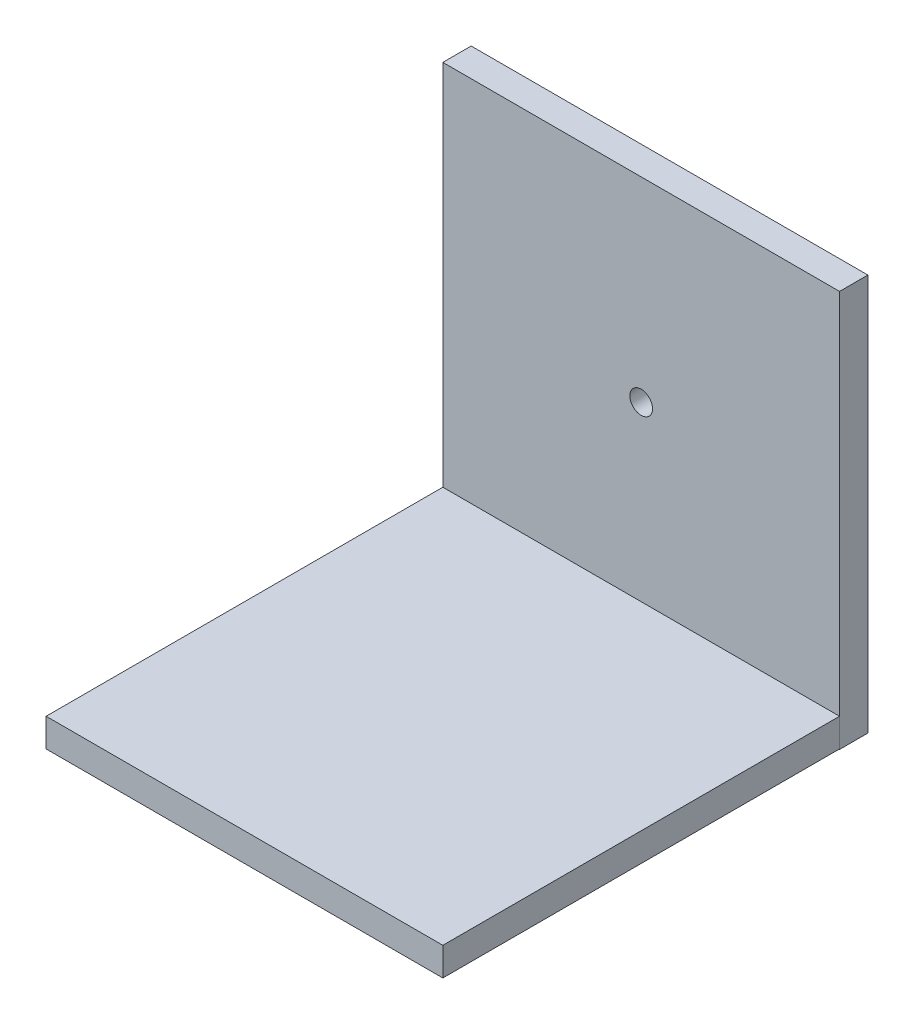
ISO-10303-21;
HEADER;
FILE_DESCRIPTION(('STEP AP214'),'2;1');
FILE_NAME('part.step','',(''),(''),'','','');
FILE_SCHEMA(('AUTOMOTIVE_DESIGN { 1 0 10303 214 1 1 1 1 }'));
ENDSEC;
DATA;
#1=APPLICATION_CONTEXT('core data for automotive mechanical design processes');
#2=APPLICATION_PROTOCOL_DEFINITION('international standard','automotive_design',2000,#1);
#3=PRODUCT_CONTEXT('',#1,'mechanical');
#4=PRODUCT('Part','Part','',(#3));
#5=PRODUCT_RELATED_PRODUCT_CATEGORY('part','',(#4));
#6=PRODUCT_DEFINITION_FORMATION('','',#4);
#7=PRODUCT_DEFINITION_CONTEXT('part definition',#1,'design');
#8=PRODUCT_DEFINITION('design','',#6,#7);
#9=PRODUCT_DEFINITION_SHAPE('','',#8);
#10=(LENGTH_UNIT() NAMED_UNIT(*) SI_UNIT(.MILLI.,.METRE.));
#11=(NAMED_UNIT(*) PLANE_ANGLE_UNIT() SI_UNIT($,.RADIAN.));
#12=(NAMED_UNIT(*) SI_UNIT($,.STERADIAN.) SOLID_ANGLE_UNIT());
#13=UNCERTAINTY_MEASURE_WITH_UNIT(LENGTH_MEASURE(1.E-05),#10,'distance_accuracy_value','');
#14=(GEOMETRIC_REPRESENTATION_CONTEXT(3) GLOBAL_UNCERTAINTY_ASSIGNED_CONTEXT((#13)) GLOBAL_UNIT_ASSIGNED_CONTEXT((#10,
#11,#12)) REPRESENTATION_CONTEXT('',''));
#15=CARTESIAN_POINT('',(0.,0.,0.));
#16=DIRECTION('',(0.,0.,1.));
#17=DIRECTION('',(1.,0.,0.));
#18=AXIS2_PLACEMENT_3D('',#15,#16,#17);
#19=CARTESIAN_POINT('',(0.,-5.,0.));
#20=DIRECTION('',(0.,0.,1.));
#21=DIRECTION('',(1.,0.,0.));
#22=AXIS2_PLACEMENT_3D('',#19,#20,#21);
#23=PLANE('',#22);
#24=DIRECTION('',(1.,0.,0.));
#25=VECTOR('',#24,1.);
#26=CARTESIAN_POINT('',(0.,0.,0.));
#27=LINE('',#26,#25);
#28=CARTESIAN_POINT('',(0.,0.,0.));
#29=VERTEX_POINT('',#28);
#30=CARTESIAN_POINT('',(70.,0.,0.));
#31=VERTEX_POINT('',#30);
#32=EDGE_CURVE('E108',#29,#31,#27,.T.);
#33=ORIENTED_EDGE('',*,*,#32,.T.);
#34=DIRECTION('',(0.,1.,0.));
#35=VECTOR('',#34,1.);
#36=CARTESIAN_POINT('',(70.,-5.,0.));
#37=LINE('',#36,#35);
#38=CARTESIAN_POINT('',(70.,-5.,0.));
#39=VERTEX_POINT('',#38);
#40=EDGE_CURVE('E12',#39,#31,#37,.T.);
#41=ORIENTED_EDGE('',*,*,#40,.F.);
#42=DIRECTION('',(1.,0.,0.));
#43=VECTOR('',#42,1.);
#44=CARTESIAN_POINT('',(0.,-5.,0.));
#45=LINE('',#44,#43);
#46=CARTESIAN_POINT('',(0.,-5.,0.));
#47=VERTEX_POINT('',#46);
#48=EDGE_CURVE('E94',#47,#39,#45,.T.);
#49=ORIENTED_EDGE('',*,*,#48,.F.);
#50=DIRECTION('',(0.,1.,0.));
#51=VECTOR('',#50,1.);
#52=CARTESIAN_POINT('',(0.,-5.,0.));
#53=LINE('',#52,#51);
#54=EDGE_CURVE('E61',#47,#29,#53,.T.);
#55=ORIENTED_EDGE('',*,*,#54,.T.);
#56=EDGE_LOOP('',(#33,#41,#49,#55));
#57=FACE_BOUND('',#56,.T.);
#58=ADVANCED_FACE('F45',(#57),#23,.F.);
#59=CARTESIAN_POINT('',(70.,-5.,0.));
#60=DIRECTION('',(-1.,0.,0.));
#61=DIRECTION('',(0.,0.,1.));
#62=AXIS2_PLACEMENT_3D('',#59,#60,#61);
#63=PLANE('',#62);
#64=DIRECTION('',(0.,0.,1.));
#65=VECTOR('',#64,1.);
#66=CARTESIAN_POINT('',(70.,0.,0.));
#67=LINE('',#66,#65);
#68=CARTESIAN_POINT('',(70.,0.,70.));
#69=VERTEX_POINT('',#68);
#70=EDGE_CURVE('E99',#31,#69,#67,.T.);
#71=ORIENTED_EDGE('',*,*,#70,.T.);
#72=DIRECTION('',(0.,1.,0.));
#73=VECTOR('',#72,1.);
#74=CARTESIAN_POINT('',(70.,-5.,70.));
#75=LINE('',#74,#73);
#76=CARTESIAN_POINT('',(70.,-5.,70.));
#77=VERTEX_POINT('',#76);
#78=EDGE_CURVE('E53',#77,#69,#75,.T.);
#79=ORIENTED_EDGE('',*,*,#78,.F.);
#80=DIRECTION('',(0.,0.,1.));
#81=VECTOR('',#80,1.);
#82=CARTESIAN_POINT('',(70.,-5.,0.));
#83=LINE('',#82,#81);
#84=EDGE_CURVE('E86',#39,#77,#83,.T.);
#85=ORIENTED_EDGE('',*,*,#84,.F.);
#86=ORIENTED_EDGE('',*,*,#40,.T.);
#87=EDGE_LOOP('',(#71,#79,#85,#86));
#88=FACE_BOUND('',#87,.T.);
#89=ADVANCED_FACE('F98',(#88),#63,.F.);
#90=CARTESIAN_POINT('',(0.,-5.,70.));
#91=DIRECTION('',(0.,0.,1.));
#92=DIRECTION('',(1.,0.,0.));
#93=AXIS2_PLACEMENT_3D('',#90,#91,#92);
#94=PLANE('',#93);
#95=DIRECTION('',(1.,0.,0.));
#96=VECTOR('',#95,1.);
#97=CARTESIAN_POINT('',(0.,0.,70.));
#98=LINE('',#97,#96);
#99=CARTESIAN_POINT('',(0.,0.,70.));
#100=VERTEX_POINT('',#99);
#101=EDGE_CURVE('E111',#100,#69,#98,.T.);
#102=ORIENTED_EDGE('',*,*,#101,.F.);
#103=DIRECTION('',(0.,1.,0.));
#104=VECTOR('',#103,1.);
#105=CARTESIAN_POINT('',(0.,-5.,70.));
#106=LINE('',#105,#104);
#107=CARTESIAN_POINT('',(0.,-5.,70.));
#108=VERTEX_POINT('',#107);
#109=EDGE_CURVE('E75',#108,#100,#106,.T.);
#110=ORIENTED_EDGE('',*,*,#109,.F.);
#111=DIRECTION('',(1.,0.,0.));
#112=VECTOR('',#111,1.);
#113=CARTESIAN_POINT('',(0.,-5.,70.));
#114=LINE('',#113,#112);
#115=EDGE_CURVE('E93',#108,#77,#114,.T.);
#116=ORIENTED_EDGE('',*,*,#115,.T.);
#117=ORIENTED_EDGE('',*,*,#78,.T.);
#118=EDGE_LOOP('',(#102,#110,#116,#117));
#119=FACE_BOUND('',#118,.T.);
#120=ADVANCED_FACE('F102',(#119),#94,.T.);
#121=CARTESIAN_POINT('',(0.,-5.,0.));
#122=DIRECTION('',(-1.,0.,0.));
#123=DIRECTION('',(0.,0.,1.));
#124=AXIS2_PLACEMENT_3D('',#121,#122,#123);
#125=PLANE('',#124);
#126=DIRECTION('',(0.,0.,1.));
#127=VECTOR('',#126,1.);
#128=CARTESIAN_POINT('',(0.,0.,0.));
#129=LINE('',#128,#127);
#130=EDGE_CURVE('E113',#29,#100,#129,.T.);
#131=ORIENTED_EDGE('',*,*,#130,.F.);
#132=ORIENTED_EDGE('',*,*,#54,.F.);
#133=DIRECTION('',(0.,0.,1.));
#134=VECTOR('',#133,1.);
#135=CARTESIAN_POINT('',(0.,-5.,0.));
#136=LINE('',#135,#134);
#137=EDGE_CURVE('E103',#47,#108,#136,.T.);
#138=ORIENTED_EDGE('',*,*,#137,.T.);
#139=ORIENTED_EDGE('',*,*,#109,.T.);
#140=EDGE_LOOP('',(#131,#132,#138,#139));
#141=FACE_BOUND('',#140,.T.);
#142=ADVANCED_FACE('F119',(#141),#125,.T.);
#143=CARTESIAN_POINT('',(0.,-5.,0.));
#144=DIRECTION('',(0.,-1.,0.));
#145=DIRECTION('',(0.,0.,-1.));
#146=AXIS2_PLACEMENT_3D('',#143,#144,#145);
#147=PLANE('',#146);
#148=ORIENTED_EDGE('',*,*,#48,.T.);
#149=ORIENTED_EDGE('',*,*,#84,.T.);
#150=ORIENTED_EDGE('',*,*,#115,.F.);
#151=ORIENTED_EDGE('',*,*,#137,.F.);
#152=EDGE_LOOP('',(#148,#149,#150,#151));
#153=FACE_BOUND('',#152,.T.);
#154=ADVANCED_FACE('F90',(#153),#147,.T.);
#155=CARTESIAN_POINT('',(0.,0.,0.));
#156=DIRECTION('',(0.,-1.,0.));
#157=DIRECTION('',(0.,0.,-1.));
#158=AXIS2_PLACEMENT_3D('',#155,#156,#157);
#159=PLANE('',#158);
#160=ORIENTED_EDGE('',*,*,#32,.F.);
#161=ORIENTED_EDGE('',*,*,#130,.T.);
#162=ORIENTED_EDGE('',*,*,#101,.T.);
#163=ORIENTED_EDGE('',*,*,#70,.F.);
#164=EDGE_LOOP('',(#160,#161,#162,#163));
#165=FACE_BOUND('',#164,.T.);
#166=ADVANCED_FACE('F118',(#165),#159,.F.);
#167=CLOSED_SHELL('',(#58,#89,#120,#142,#154,#166));
#168=MANIFOLD_SOLID_BREP('B2',#167);
#169=CARTESIAN_POINT('',(0.,-5.07848502504413,-5.));
#170=DIRECTION('',(-1.,0.,0.));
#171=DIRECTION('',(0.,0.,1.));
#172=AXIS2_PLACEMENT_3D('',#169,#170,#171);
#173=PLANE('',#172);
#174=DIRECTION('',(0.,-1.,0.));
#175=VECTOR('',#174,1.);
#176=CARTESIAN_POINT('',(0.,-5.07848502504413,0.));
#177=LINE('',#176,#175);
#178=CARTESIAN_POINT('',(0.,64.9215149749559,0.));
#179=VERTEX_POINT('',#178);
#180=CARTESIAN_POINT('',(0.,-5.07848502504413,0.));
#181=VERTEX_POINT('',#180);
#182=EDGE_CURVE('E234',#179,#181,#177,.T.);
#183=ORIENTED_EDGE('',*,*,#182,.F.);
#184=DIRECTION('',(0.,0.,1.));
#185=VECTOR('',#184,1.);
#186=CARTESIAN_POINT('',(0.,64.9215149749559,-5.));
#187=LINE('',#186,#185);
#188=CARTESIAN_POINT('',(0.,64.9215149749559,-5.));
#189=VERTEX_POINT('',#188);
#190=EDGE_CURVE('E43',#189,#179,#187,.T.);
#191=ORIENTED_EDGE('',*,*,#190,.F.);
#192=DIRECTION('',(0.,-1.,0.));
#193=VECTOR('',#192,1.);
#194=CARTESIAN_POINT('',(0.,-5.07848502504413,-5.));
#195=LINE('',#194,#193);
#196=CARTESIAN_POINT('',(0.,-5.07848502504413,-5.));
#197=VERTEX_POINT('',#196);
#198=EDGE_CURVE('E227',#189,#197,#195,.T.);
#199=ORIENTED_EDGE('',*,*,#198,.T.);
#200=DIRECTION('',(0.,0.,1.));
#201=VECTOR('',#200,1.);
#202=CARTESIAN_POINT('',(0.,-5.07848502504413,-5.));
#203=LINE('',#202,#201);
#204=EDGE_CURVE('E172',#197,#181,#203,.T.);
#205=ORIENTED_EDGE('',*,*,#204,.T.);
#206=EDGE_LOOP('',(#183,#191,#199,#205));
#207=FACE_BOUND('',#206,.T.);
#208=ADVANCED_FACE('F169',(#207),#173,.T.);
#209=CARTESIAN_POINT('',(0.,64.9215149749559,-5.));
#210=DIRECTION('',(0.,1.,0.));
#211=DIRECTION('',(0.,0.,1.));
#212=AXIS2_PLACEMENT_3D('',#209,#210,#211);
#213=PLANE('',#212);
#214=DIRECTION('',(-1.,0.,0.));
#215=VECTOR('',#214,1.);
#216=CARTESIAN_POINT('',(0.,64.9215149749559,0.));
#217=LINE('',#216,#215);
#218=CARTESIAN_POINT('',(70.,64.9215149749559,0.));
#219=VERTEX_POINT('',#218);
#220=EDGE_CURVE('E229',#219,#179,#217,.T.);
#221=ORIENTED_EDGE('',*,*,#220,.F.);
#222=DIRECTION('',(0.,0.,1.));
#223=VECTOR('',#222,1.);
#224=CARTESIAN_POINT('',(70.,64.9215149749559,-5.));
#225=LINE('',#224,#223);
#226=CARTESIAN_POINT('',(70.,64.9215149749559,-5.));
#227=VERTEX_POINT('',#226);
#228=EDGE_CURVE('E178',#227,#219,#225,.T.);
#229=ORIENTED_EDGE('',*,*,#228,.F.);
#230=DIRECTION('',(-1.,0.,0.));
#231=VECTOR('',#230,1.);
#232=CARTESIAN_POINT('',(0.,64.9215149749559,-5.));
#233=LINE('',#232,#231);
#234=EDGE_CURVE('E224',#227,#189,#233,.T.);
#235=ORIENTED_EDGE('',*,*,#234,.T.);
#236=ORIENTED_EDGE('',*,*,#190,.T.);
#237=EDGE_LOOP('',(#221,#229,#235,#236));
#238=FACE_BOUND('',#237,.T.);
#239=ADVANCED_FACE('F245',(#238),#213,.T.);
#240=CARTESIAN_POINT('',(70.,-5.07848502504413,-5.));
#241=DIRECTION('',(1.,0.,0.));
#242=DIRECTION('',(0.,0.,-1.));
#243=AXIS2_PLACEMENT_3D('',#240,#241,#242);
#244=PLANE('',#243);
#245=DIRECTION('',(0.,1.,0.));
#246=VECTOR('',#245,1.);
#247=CARTESIAN_POINT('',(70.,-5.07848502504413,0.));
#248=LINE('',#247,#246);
#249=CARTESIAN_POINT('',(70.,-5.07848502504413,0.));
#250=VERTEX_POINT('',#249);
#251=EDGE_CURVE('E219',#250,#219,#248,.T.);
#252=ORIENTED_EDGE('',*,*,#251,.F.);
#253=DIRECTION('',(0.,0.,1.));
#254=VECTOR('',#253,1.);
#255=CARTESIAN_POINT('',(70.,-5.07848502504413,-5.));
#256=LINE('',#255,#254);
#257=CARTESIAN_POINT('',(70.,-5.07848502504413,-5.));
#258=VERTEX_POINT('',#257);
#259=EDGE_CURVE('E214',#258,#250,#256,.T.);
#260=ORIENTED_EDGE('',*,*,#259,.F.);
#261=DIRECTION('',(0.,1.,0.));
#262=VECTOR('',#261,1.);
#263=CARTESIAN_POINT('',(70.,-5.07848502504413,-5.));
#264=LINE('',#263,#262);
#265=EDGE_CURVE('E217',#258,#227,#264,.T.);
#266=ORIENTED_EDGE('',*,*,#265,.T.);
#267=ORIENTED_EDGE('',*,*,#228,.T.);
#268=EDGE_LOOP('',(#252,#260,#266,#267));
#269=FACE_BOUND('',#268,.T.);
#270=ADVANCED_FACE('F216',(#269),#244,.T.);
#271=CARTESIAN_POINT('',(0.,-5.07848502504413,-5.));
#272=DIRECTION('',(0.,-1.,0.));
#273=DIRECTION('',(0.,0.,-1.));
#274=AXIS2_PLACEMENT_3D('',#271,#272,#273);
#275=PLANE('',#274);
#276=DIRECTION('',(1.,0.,0.));
#277=VECTOR('',#276,1.);
#278=CARTESIAN_POINT('',(0.,-5.07848502504413,0.));
#279=LINE('',#278,#277);
#280=EDGE_CURVE('E237',#181,#250,#279,.T.);
#281=ORIENTED_EDGE('',*,*,#280,.F.);
#282=ORIENTED_EDGE('',*,*,#204,.F.);
#283=DIRECTION('',(1.,0.,0.));
#284=VECTOR('',#283,1.);
#285=CARTESIAN_POINT('',(0.,-5.07848502504413,-5.));
#286=LINE('',#285,#284);
#287=EDGE_CURVE('E223',#197,#258,#286,.T.);
#288=ORIENTED_EDGE('',*,*,#287,.T.);
#289=ORIENTED_EDGE('',*,*,#259,.T.);
#290=EDGE_LOOP('',(#281,#282,#288,#289));
#291=FACE_BOUND('',#290,.T.);
#292=ADVANCED_FACE('F226',(#291),#275,.T.);
#293=CARTESIAN_POINT('',(0.,0.,-5.));
#294=DIRECTION('',(0.,0.,-1.));
#295=DIRECTION('',(-1.,0.,0.));
#296=AXIS2_PLACEMENT_3D('',#293,#294,#295);
#297=PLANE('',#296);
#298=CARTESIAN_POINT('',(35.,30.4774658874578,-5.));
#299=DIRECTION('',(0.,0.,-1.));
#300=DIRECTION('',(-1.,0.,0.));
#301=AXIS2_PLACEMENT_3D('',#298,#299,#300);
#302=CIRCLE('',#301,2.);
#303=CARTESIAN_POINT('',(33.,30.4774658874578,-5.));
#304=VERTEX_POINT('',#303);
#305=EDGE_CURVE('E275',#304,#304,#302,.T.);
#306=ORIENTED_EDGE('',*,*,#305,.F.);
#307=EDGE_LOOP('',(#306));
#308=FACE_BOUND('',#307,.T.);
#309=ORIENTED_EDGE('',*,*,#198,.F.);
#310=ORIENTED_EDGE('',*,*,#234,.F.);
#311=ORIENTED_EDGE('',*,*,#265,.F.);
#312=ORIENTED_EDGE('',*,*,#287,.F.);
#313=EDGE_LOOP('',(#309,#310,#311,#312));
#314=FACE_BOUND('',#313,.T.);
#315=ADVANCED_FACE('F222',(#308,#314),#297,.T.);
#316=CARTESIAN_POINT('',(0.,0.,0.));
#317=DIRECTION('',(0.,0.,-1.));
#318=DIRECTION('',(-1.,0.,0.));
#319=AXIS2_PLACEMENT_3D('',#316,#317,#318);
#320=PLANE('',#319);
#321=CARTESIAN_POINT('',(35.,30.4774658874578,0.));
#322=DIRECTION('',(0.,0.,-1.));
#323=DIRECTION('',(-1.,0.,0.));
#324=AXIS2_PLACEMENT_3D('',#321,#322,#323);
#325=CIRCLE('',#324,2.);
#326=CARTESIAN_POINT('',(33.,30.4774658874578,0.));
#327=VERTEX_POINT('',#326);
#328=EDGE_CURVE('E238',#327,#327,#325,.T.);
#329=ORIENTED_EDGE('',*,*,#328,.T.);
#330=EDGE_LOOP('',(#329));
#331=FACE_BOUND('',#330,.T.);
#332=ORIENTED_EDGE('',*,*,#182,.T.);
#333=ORIENTED_EDGE('',*,*,#280,.T.);
#334=ORIENTED_EDGE('',*,*,#251,.T.);
#335=ORIENTED_EDGE('',*,*,#220,.T.);
#336=EDGE_LOOP('',(#332,#333,#334,#335));
#337=FACE_BOUND('',#336,.T.);
#338=ADVANCED_FACE('F244',(#331,#337),#320,.F.);
#339=CARTESIAN_POINT('',(35.,30.4774658874578,0.));
#340=DIRECTION('',(0.,0.,-1.));
#341=DIRECTION('',(-1.,0.,0.));
#342=AXIS2_PLACEMENT_3D('',#339,#340,#341);
#343=CYLINDRICAL_SURFACE('',#342,2.);
#344=ORIENTED_EDGE('',*,*,#328,.F.);
#345=EDGE_LOOP('',(#344));
#346=FACE_BOUND('',#345,.T.);
#347=ORIENTED_EDGE('',*,*,#305,.T.);
#348=EDGE_LOOP('',(#347));
#349=FACE_BOUND('',#348,.T.);
#350=ADVANCED_FACE('F263',(#346,#349),#343,.F.);
#351=CLOSED_SHELL('',(#208,#239,#270,#292,#315,#338,#350));
#352=MANIFOLD_SOLID_BREP('B6',#351);
#353=ADVANCED_BREP_SHAPE_REPRESENTATION('',(#18,#168,#352),#14);
#354=SHAPE_DEFINITION_REPRESENTATION(#9,#353);
ENDSEC;
END-ISO-10303-21;
